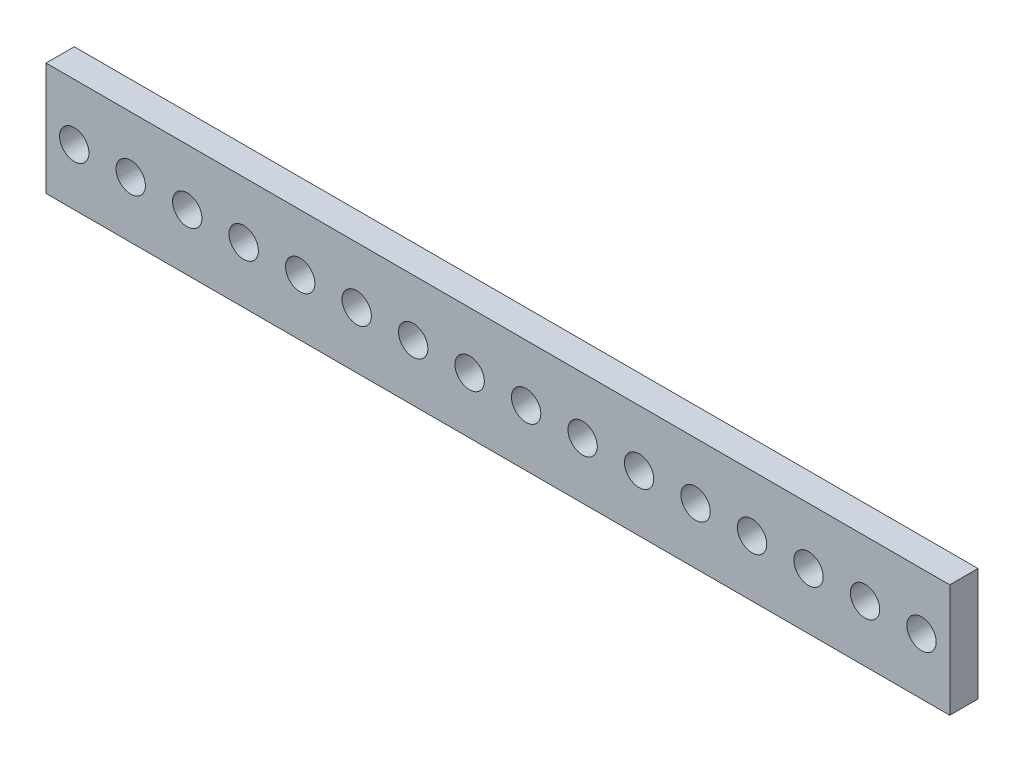
ISO-10303-21;
HEADER;
FILE_DESCRIPTION(('STEP AP214'),'2;1');
FILE_NAME('part.step','',(''),(''),'','','');
FILE_SCHEMA(('AUTOMOTIVE_DESIGN { 1 0 10303 214 1 1 1 1 }'));
ENDSEC;
DATA;
#1=APPLICATION_CONTEXT('core data for automotive mechanical design processes');
#2=APPLICATION_PROTOCOL_DEFINITION('international standard','automotive_design',2000,#1);
#3=PRODUCT_CONTEXT('',#1,'mechanical');
#4=PRODUCT('Part','Part','',(#3));
#5=PRODUCT_RELATED_PRODUCT_CATEGORY('part','',(#4));
#6=PRODUCT_DEFINITION_FORMATION('','',#4);
#7=PRODUCT_DEFINITION_CONTEXT('part definition',#1,'design');
#8=PRODUCT_DEFINITION('design','',#6,#7);
#9=PRODUCT_DEFINITION_SHAPE('','',#8);
#10=(LENGTH_UNIT() NAMED_UNIT(*) SI_UNIT(.MILLI.,.METRE.));
#11=(NAMED_UNIT(*) PLANE_ANGLE_UNIT() SI_UNIT($,.RADIAN.));
#12=(NAMED_UNIT(*) SI_UNIT($,.STERADIAN.) SOLID_ANGLE_UNIT());
#13=UNCERTAINTY_MEASURE_WITH_UNIT(LENGTH_MEASURE(1.E-05),#10,'distance_accuracy_value','');
#14=(GEOMETRIC_REPRESENTATION_CONTEXT(3) GLOBAL_UNCERTAINTY_ASSIGNED_CONTEXT((#13)) GLOBAL_UNIT_ASSIGNED_CONTEXT((#10,
#11,#12)) REPRESENTATION_CONTEXT('',''));
#15=CARTESIAN_POINT('',(0.,0.,0.));
#16=DIRECTION('',(0.,0.,1.));
#17=DIRECTION('',(1.,0.,0.));
#18=AXIS2_PLACEMENT_3D('',#15,#16,#17);
#19=CARTESIAN_POINT('',(0.,0.,3.175));
#20=DIRECTION('',(0.,0.,-1.));
#21=DIRECTION('',(-1.,0.,0.));
#22=AXIS2_PLACEMENT_3D('',#19,#20,#21);
#23=PLANE('',#22);
#24=CARTESIAN_POINT('',(53.975,6.35,3.175));
#25=DIRECTION('',(0.,0.,-1.));
#26=DIRECTION('',(-1.,0.,0.));
#27=AXIS2_PLACEMENT_3D('',#24,#25,#26);
#28=CIRCLE('',#27,1.651);
#29=CARTESIAN_POINT('',(52.324,6.35,3.175));
#30=VERTEX_POINT('',#29);
#31=EDGE_CURVE('E165',#30,#30,#28,.T.);
#32=ORIENTED_EDGE('',*,*,#31,.T.);
#33=EDGE_LOOP('',(#32));
#34=FACE_BOUND('',#33,.T.);
#35=CARTESIAN_POINT('',(60.325,6.35,3.175));
#36=DIRECTION('',(0.,0.,-1.));
#37=DIRECTION('',(-1.,0.,0.));
#38=AXIS2_PLACEMENT_3D('',#35,#36,#37);
#39=CIRCLE('',#38,1.651);
#40=CARTESIAN_POINT('',(58.674,6.35,3.175));
#41=VERTEX_POINT('',#40);
#42=EDGE_CURVE('E160',#41,#41,#39,.T.);
#43=ORIENTED_EDGE('',*,*,#42,.T.);
#44=EDGE_LOOP('',(#43));
#45=FACE_BOUND('',#44,.T.);
#46=CARTESIAN_POINT('',(66.675,6.35,3.175));
#47=DIRECTION('',(0.,0.,-1.));
#48=DIRECTION('',(-1.,0.,0.));
#49=AXIS2_PLACEMENT_3D('',#46,#47,#48);
#50=CIRCLE('',#49,1.65099999999999);
#51=CARTESIAN_POINT('',(65.024,6.35,3.175));
#52=VERTEX_POINT('',#51);
#53=EDGE_CURVE('E155',#52,#52,#50,.T.);
#54=ORIENTED_EDGE('',*,*,#53,.T.);
#55=EDGE_LOOP('',(#54));
#56=FACE_BOUND('',#55,.T.);
#57=CARTESIAN_POINT('',(73.025,6.35,3.175));
#58=DIRECTION('',(0.,0.,-1.));
#59=DIRECTION('',(-1.,0.,0.));
#60=AXIS2_PLACEMENT_3D('',#57,#58,#59);
#61=CIRCLE('',#60,1.65100000000001);
#62=CARTESIAN_POINT('',(71.374,6.35,3.175));
#63=VERTEX_POINT('',#62);
#64=EDGE_CURVE('E150',#63,#63,#61,.T.);
#65=ORIENTED_EDGE('',*,*,#64,.T.);
#66=EDGE_LOOP('',(#65));
#67=FACE_BOUND('',#66,.T.);
#68=CARTESIAN_POINT('',(79.375,6.35,3.175));
#69=DIRECTION('',(0.,0.,-1.));
#70=DIRECTION('',(-1.,0.,0.));
#71=AXIS2_PLACEMENT_3D('',#68,#69,#70);
#72=CIRCLE('',#71,1.65100000000001);
#73=CARTESIAN_POINT('',(77.724,6.35,3.175));
#74=VERTEX_POINT('',#73);
#75=EDGE_CURVE('E145',#74,#74,#72,.T.);
#76=ORIENTED_EDGE('',*,*,#75,.T.);
#77=EDGE_LOOP('',(#76));
#78=FACE_BOUND('',#77,.T.);
#79=CARTESIAN_POINT('',(85.725,6.35,3.175));
#80=DIRECTION('',(0.,0.,-1.));
#81=DIRECTION('',(-1.,0.,0.));
#82=AXIS2_PLACEMENT_3D('',#79,#80,#81);
#83=CIRCLE('',#82,1.65099999999999);
#84=CARTESIAN_POINT('',(84.074,6.35,3.175));
#85=VERTEX_POINT('',#84);
#86=EDGE_CURVE('E140',#85,#85,#83,.T.);
#87=ORIENTED_EDGE('',*,*,#86,.T.);
#88=EDGE_LOOP('',(#87));
#89=FACE_BOUND('',#88,.T.);
#90=CARTESIAN_POINT('',(92.075,6.35,3.175));
#91=DIRECTION('',(0.,0.,-1.));
#92=DIRECTION('',(-1.,0.,0.));
#93=AXIS2_PLACEMENT_3D('',#90,#91,#92);
#94=CIRCLE('',#93,1.65100000000001);
#95=CARTESIAN_POINT('',(90.424,6.35,3.175));
#96=VERTEX_POINT('',#95);
#97=EDGE_CURVE('E135',#96,#96,#94,.T.);
#98=ORIENTED_EDGE('',*,*,#97,.T.);
#99=EDGE_LOOP('',(#98));
#100=FACE_BOUND('',#99,.T.);
#101=CARTESIAN_POINT('',(98.425,6.35,3.175));
#102=DIRECTION('',(0.,0.,-1.));
#103=DIRECTION('',(-1.,0.,0.));
#104=AXIS2_PLACEMENT_3D('',#101,#102,#103);
#105=CIRCLE('',#104,1.65100000000001);
#106=CARTESIAN_POINT('',(96.774,6.35,3.175));
#107=VERTEX_POINT('',#106);
#108=EDGE_CURVE('E130',#107,#107,#105,.T.);
#109=ORIENTED_EDGE('',*,*,#108,.T.);
#110=EDGE_LOOP('',(#109));
#111=FACE_BOUND('',#110,.T.);
#112=DIRECTION('',(0.,-1.,0.));
#113=VECTOR('',#112,1.);
#114=CARTESIAN_POINT('',(0.,0.,3.175));
#115=LINE('',#114,#113);
#116=CARTESIAN_POINT('',(0.,12.7,3.175));
#117=VERTEX_POINT('',#116);
#118=CARTESIAN_POINT('',(0.,0.,3.175));
#119=VERTEX_POINT('',#118);
#120=EDGE_CURVE('E94',#117,#119,#115,.T.);
#121=ORIENTED_EDGE('',*,*,#120,.T.);
#122=DIRECTION('',(1.,0.,0.));
#123=VECTOR('',#122,1.);
#124=CARTESIAN_POINT('',(0.,0.,3.175));
#125=LINE('',#124,#123);
#126=CARTESIAN_POINT('',(101.6,0.,3.175));
#127=VERTEX_POINT('',#126);
#128=EDGE_CURVE('E89',#119,#127,#125,.T.);
#129=ORIENTED_EDGE('',*,*,#128,.T.);
#130=DIRECTION('',(0.,1.,0.));
#131=VECTOR('',#130,1.);
#132=CARTESIAN_POINT('',(101.6,0.,3.175));
#133=LINE('',#132,#131);
#134=CARTESIAN_POINT('',(101.6,12.7,3.175));
#135=VERTEX_POINT('',#134);
#136=EDGE_CURVE('E92',#127,#135,#133,.T.);
#137=ORIENTED_EDGE('',*,*,#136,.T.);
#138=DIRECTION('',(-1.,0.,0.));
#139=VECTOR('',#138,1.);
#140=CARTESIAN_POINT('',(0.,12.7,3.175));
#141=LINE('',#140,#139);
#142=EDGE_CURVE('E59',#135,#117,#141,.T.);
#143=ORIENTED_EDGE('',*,*,#142,.T.);
#144=EDGE_LOOP('',(#121,#129,#137,#143));
#145=FACE_BOUND('',#144,.T.);
#146=CARTESIAN_POINT('',(47.625,6.35,3.175));
#147=DIRECTION('',(0.,0.,-1.));
#148=DIRECTION('',(-1.,0.,0.));
#149=AXIS2_PLACEMENT_3D('',#146,#147,#148);
#150=CIRCLE('',#149,1.651);
#151=CARTESIAN_POINT('',(45.974,6.35,3.175));
#152=VERTEX_POINT('',#151);
#153=EDGE_CURVE('E170',#152,#152,#150,.F.);
#154=ORIENTED_EDGE('',*,*,#153,.F.);
#155=EDGE_LOOP('',(#154));
#156=FACE_BOUND('',#155,.T.);
#157=CARTESIAN_POINT('',(41.275,6.35,3.175));
#158=DIRECTION('',(0.,0.,-1.));
#159=DIRECTION('',(-1.,0.,0.));
#160=AXIS2_PLACEMENT_3D('',#157,#158,#159);
#161=CIRCLE('',#160,1.651);
#162=CARTESIAN_POINT('',(39.624,6.35,3.175));
#163=VERTEX_POINT('',#162);
#164=EDGE_CURVE('E175',#163,#163,#161,.F.);
#165=ORIENTED_EDGE('',*,*,#164,.F.);
#166=EDGE_LOOP('',(#165));
#167=FACE_BOUND('',#166,.T.);
#168=CARTESIAN_POINT('',(34.925,6.35,3.175));
#169=DIRECTION('',(0.,0.,-1.));
#170=DIRECTION('',(-1.,0.,0.));
#171=AXIS2_PLACEMENT_3D('',#168,#169,#170);
#172=CIRCLE('',#171,1.651);
#173=CARTESIAN_POINT('',(33.274,6.35,3.175));
#174=VERTEX_POINT('',#173);
#175=EDGE_CURVE('E180',#174,#174,#172,.F.);
#176=ORIENTED_EDGE('',*,*,#175,.F.);
#177=EDGE_LOOP('',(#176));
#178=FACE_BOUND('',#177,.T.);
#179=CARTESIAN_POINT('',(28.575,6.35,3.175));
#180=DIRECTION('',(0.,0.,-1.));
#181=DIRECTION('',(-1.,0.,0.));
#182=AXIS2_PLACEMENT_3D('',#179,#180,#181);
#183=CIRCLE('',#182,1.651);
#184=CARTESIAN_POINT('',(26.924,6.35,3.175));
#185=VERTEX_POINT('',#184);
#186=EDGE_CURVE('E185',#185,#185,#183,.F.);
#187=ORIENTED_EDGE('',*,*,#186,.F.);
#188=EDGE_LOOP('',(#187));
#189=FACE_BOUND('',#188,.T.);
#190=CARTESIAN_POINT('',(22.225,6.35,3.175));
#191=DIRECTION('',(0.,0.,-1.));
#192=DIRECTION('',(-1.,0.,0.));
#193=AXIS2_PLACEMENT_3D('',#190,#191,#192);
#194=CIRCLE('',#193,1.651);
#195=CARTESIAN_POINT('',(20.574,6.35,3.175));
#196=VERTEX_POINT('',#195);
#197=EDGE_CURVE('E190',#196,#196,#194,.F.);
#198=ORIENTED_EDGE('',*,*,#197,.F.);
#199=EDGE_LOOP('',(#198));
#200=FACE_BOUND('',#199,.T.);
#201=CARTESIAN_POINT('',(15.875,6.35,3.175));
#202=DIRECTION('',(0.,0.,-1.));
#203=DIRECTION('',(-1.,0.,0.));
#204=AXIS2_PLACEMENT_3D('',#201,#202,#203);
#205=CIRCLE('',#204,1.651);
#206=CARTESIAN_POINT('',(14.224,6.35,3.175));
#207=VERTEX_POINT('',#206);
#208=EDGE_CURVE('E194',#207,#207,#205,.F.);
#209=ORIENTED_EDGE('',*,*,#208,.F.);
#210=EDGE_LOOP('',(#209));
#211=FACE_BOUND('',#210,.T.);
#212=CARTESIAN_POINT('',(9.525,6.35,3.175));
#213=DIRECTION('',(0.,0.,-1.));
#214=DIRECTION('',(-1.,0.,0.));
#215=AXIS2_PLACEMENT_3D('',#212,#213,#214);
#216=CIRCLE('',#215,1.651);
#217=CARTESIAN_POINT('',(7.874,6.35,3.175));
#218=VERTEX_POINT('',#217);
#219=EDGE_CURVE('E198',#218,#218,#216,.F.);
#220=ORIENTED_EDGE('',*,*,#219,.F.);
#221=EDGE_LOOP('',(#220));
#222=FACE_BOUND('',#221,.T.);
#223=CARTESIAN_POINT('',(3.175,6.35,3.175));
#224=DIRECTION('',(0.,0.,-1.));
#225=DIRECTION('',(-1.,0.,0.));
#226=AXIS2_PLACEMENT_3D('',#223,#224,#225);
#227=CIRCLE('',#226,1.651);
#228=CARTESIAN_POINT('',(1.524,6.35,3.175));
#229=VERTEX_POINT('',#228);
#230=EDGE_CURVE('E115',#229,#229,#227,.F.);
#231=ORIENTED_EDGE('',*,*,#230,.F.);
#232=EDGE_LOOP('',(#231));
#233=FACE_BOUND('',#232,.T.);
#234=ADVANCED_FACE('F39',(#34,#45,#56,#67,#78,#89,#100,#111,#145,#156,#167,#178,#189,#200,#211,
#222,#233),#23,.F.);
#235=CARTESIAN_POINT('',(0.,0.,0.));
#236=DIRECTION('',(0.,0.,-1.));
#237=DIRECTION('',(-1.,0.,0.));
#238=AXIS2_PLACEMENT_3D('',#235,#236,#237);
#239=PLANE('',#238);
#240=CARTESIAN_POINT('',(9.525,6.35,0.));
#241=DIRECTION('',(0.,0.,-1.));
#242=DIRECTION('',(-1.,0.,0.));
#243=AXIS2_PLACEMENT_3D('',#240,#241,#242);
#244=CIRCLE('',#243,1.651);
#245=CARTESIAN_POINT('',(7.874,6.35,0.));
#246=VERTEX_POINT('',#245);
#247=EDGE_CURVE('E195',#246,#246,#244,.F.);
#248=ORIENTED_EDGE('',*,*,#247,.T.);
#249=EDGE_LOOP('',(#248));
#250=FACE_BOUND('',#249,.T.);
#251=CARTESIAN_POINT('',(22.225,6.35,0.));
#252=DIRECTION('',(0.,0.,-1.));
#253=DIRECTION('',(-1.,0.,0.));
#254=AXIS2_PLACEMENT_3D('',#251,#252,#253);
#255=CIRCLE('',#254,1.651);
#256=CARTESIAN_POINT('',(20.574,6.35,0.));
#257=VERTEX_POINT('',#256);
#258=EDGE_CURVE('E186',#257,#257,#255,.F.);
#259=ORIENTED_EDGE('',*,*,#258,.T.);
#260=EDGE_LOOP('',(#259));
#261=FACE_BOUND('',#260,.T.);
#262=CARTESIAN_POINT('',(34.925,6.35,0.));
#263=DIRECTION('',(0.,0.,-1.));
#264=DIRECTION('',(-1.,0.,0.));
#265=AXIS2_PLACEMENT_3D('',#262,#263,#264);
#266=CIRCLE('',#265,1.651);
#267=CARTESIAN_POINT('',(33.274,6.35,0.));
#268=VERTEX_POINT('',#267);
#269=EDGE_CURVE('E176',#268,#268,#266,.F.);
#270=ORIENTED_EDGE('',*,*,#269,.T.);
#271=EDGE_LOOP('',(#270));
#272=FACE_BOUND('',#271,.T.);
#273=CARTESIAN_POINT('',(47.625,6.35,0.));
#274=DIRECTION('',(0.,0.,-1.));
#275=DIRECTION('',(-1.,0.,0.));
#276=AXIS2_PLACEMENT_3D('',#273,#274,#275);
#277=CIRCLE('',#276,1.651);
#278=CARTESIAN_POINT('',(45.974,6.35,0.));
#279=VERTEX_POINT('',#278);
#280=EDGE_CURVE('E166',#279,#279,#277,.F.);
#281=ORIENTED_EDGE('',*,*,#280,.T.);
#282=EDGE_LOOP('',(#281));
#283=FACE_BOUND('',#282,.T.);
#284=CARTESIAN_POINT('',(53.975,6.35,0.));
#285=DIRECTION('',(0.,0.,-1.));
#286=DIRECTION('',(-1.,0.,0.));
#287=AXIS2_PLACEMENT_3D('',#284,#285,#286);
#288=CIRCLE('',#287,1.651);
#289=CARTESIAN_POINT('',(52.324,6.35,0.));
#290=VERTEX_POINT('',#289);
#291=EDGE_CURVE('E161',#290,#290,#288,.T.);
#292=ORIENTED_EDGE('',*,*,#291,.F.);
#293=EDGE_LOOP('',(#292));
#294=FACE_BOUND('',#293,.T.);
#295=CARTESIAN_POINT('',(60.325,6.35,0.));
#296=DIRECTION('',(0.,0.,-1.));
#297=DIRECTION('',(-1.,0.,0.));
#298=AXIS2_PLACEMENT_3D('',#295,#296,#297);
#299=CIRCLE('',#298,1.651);
#300=CARTESIAN_POINT('',(58.674,6.35,0.));
#301=VERTEX_POINT('',#300);
#302=EDGE_CURVE('E156',#301,#301,#299,.T.);
#303=ORIENTED_EDGE('',*,*,#302,.F.);
#304=EDGE_LOOP('',(#303));
#305=FACE_BOUND('',#304,.T.);
#306=CARTESIAN_POINT('',(66.675,6.35,0.));
#307=DIRECTION('',(0.,0.,-1.));
#308=DIRECTION('',(-1.,0.,0.));
#309=AXIS2_PLACEMENT_3D('',#306,#307,#308);
#310=CIRCLE('',#309,1.65099999999999);
#311=CARTESIAN_POINT('',(65.024,6.35,0.));
#312=VERTEX_POINT('',#311);
#313=EDGE_CURVE('E151',#312,#312,#310,.T.);
#314=ORIENTED_EDGE('',*,*,#313,.F.);
#315=EDGE_LOOP('',(#314));
#316=FACE_BOUND('',#315,.T.);
#317=CARTESIAN_POINT('',(73.025,6.35,0.));
#318=DIRECTION('',(0.,0.,-1.));
#319=DIRECTION('',(-1.,0.,0.));
#320=AXIS2_PLACEMENT_3D('',#317,#318,#319);
#321=CIRCLE('',#320,1.65100000000001);
#322=CARTESIAN_POINT('',(71.374,6.35,0.));
#323=VERTEX_POINT('',#322);
#324=EDGE_CURVE('E146',#323,#323,#321,.T.);
#325=ORIENTED_EDGE('',*,*,#324,.F.);
#326=EDGE_LOOP('',(#325));
#327=FACE_BOUND('',#326,.T.);
#328=CARTESIAN_POINT('',(79.375,6.35,0.));
#329=DIRECTION('',(0.,0.,-1.));
#330=DIRECTION('',(-1.,0.,0.));
#331=AXIS2_PLACEMENT_3D('',#328,#329,#330);
#332=CIRCLE('',#331,1.65100000000001);
#333=CARTESIAN_POINT('',(77.724,6.35,0.));
#334=VERTEX_POINT('',#333);
#335=EDGE_CURVE('E141',#334,#334,#332,.T.);
#336=ORIENTED_EDGE('',*,*,#335,.F.);
#337=EDGE_LOOP('',(#336));
#338=FACE_BOUND('',#337,.T.);
#339=CARTESIAN_POINT('',(85.725,6.35,0.));
#340=DIRECTION('',(0.,0.,-1.));
#341=DIRECTION('',(-1.,0.,0.));
#342=AXIS2_PLACEMENT_3D('',#339,#340,#341);
#343=CIRCLE('',#342,1.65099999999999);
#344=CARTESIAN_POINT('',(84.074,6.35,0.));
#345=VERTEX_POINT('',#344);
#346=EDGE_CURVE('E136',#345,#345,#343,.T.);
#347=ORIENTED_EDGE('',*,*,#346,.F.);
#348=EDGE_LOOP('',(#347));
#349=FACE_BOUND('',#348,.T.);
#350=CARTESIAN_POINT('',(92.075,6.35,0.));
#351=DIRECTION('',(0.,0.,-1.));
#352=DIRECTION('',(-1.,0.,0.));
#353=AXIS2_PLACEMENT_3D('',#350,#351,#352);
#354=CIRCLE('',#353,1.65100000000001);
#355=CARTESIAN_POINT('',(90.424,6.35,0.));
#356=VERTEX_POINT('',#355);
#357=EDGE_CURVE('E131',#356,#356,#354,.T.);
#358=ORIENTED_EDGE('',*,*,#357,.F.);
#359=EDGE_LOOP('',(#358));
#360=FACE_BOUND('',#359,.T.);
#361=CARTESIAN_POINT('',(98.425,6.35,0.));
#362=DIRECTION('',(0.,0.,-1.));
#363=DIRECTION('',(-1.,0.,0.));
#364=AXIS2_PLACEMENT_3D('',#361,#362,#363);
#365=CIRCLE('',#364,1.65100000000001);
#366=CARTESIAN_POINT('',(96.774,6.35,0.));
#367=VERTEX_POINT('',#366);
#368=EDGE_CURVE('E126',#367,#367,#365,.T.);
#369=ORIENTED_EDGE('',*,*,#368,.F.);
#370=EDGE_LOOP('',(#369));
#371=FACE_BOUND('',#370,.T.);
#372=DIRECTION('',(0.,-1.,0.));
#373=VECTOR('',#372,1.);
#374=CARTESIAN_POINT('',(0.,0.,0.));
#375=LINE('',#374,#373);
#376=CARTESIAN_POINT('',(0.,12.7,0.));
#377=VERTEX_POINT('',#376);
#378=CARTESIAN_POINT('',(0.,0.,0.));
#379=VERTEX_POINT('',#378);
#380=EDGE_CURVE('E111',#377,#379,#375,.T.);
#381=ORIENTED_EDGE('',*,*,#380,.F.);
#382=DIRECTION('',(-1.,0.,0.));
#383=VECTOR('',#382,1.);
#384=CARTESIAN_POINT('',(0.,12.7,0.));
#385=LINE('',#384,#383);
#386=CARTESIAN_POINT('',(101.6,12.7,0.));
#387=VERTEX_POINT('',#386);
#388=EDGE_CURVE('E82',#387,#377,#385,.T.);
#389=ORIENTED_EDGE('',*,*,#388,.F.);
#390=DIRECTION('',(0.,1.,0.));
#391=VECTOR('',#390,1.);
#392=CARTESIAN_POINT('',(101.6,0.,0.));
#393=LINE('',#392,#391);
#394=CARTESIAN_POINT('',(101.6,0.,0.));
#395=VERTEX_POINT('',#394);
#396=EDGE_CURVE('E76',#395,#387,#393,.T.);
#397=ORIENTED_EDGE('',*,*,#396,.F.);
#398=DIRECTION('',(1.,0.,0.));
#399=VECTOR('',#398,1.);
#400=CARTESIAN_POINT('',(0.,0.,0.));
#401=LINE('',#400,#399);
#402=EDGE_CURVE('E99',#379,#395,#401,.T.);
#403=ORIENTED_EDGE('',*,*,#402,.F.);
#404=EDGE_LOOP('',(#381,#389,#397,#403));
#405=FACE_BOUND('',#404,.T.);
#406=CARTESIAN_POINT('',(41.275,6.35,0.));
#407=DIRECTION('',(0.,0.,-1.));
#408=DIRECTION('',(-1.,0.,0.));
#409=AXIS2_PLACEMENT_3D('',#406,#407,#408);
#410=CIRCLE('',#409,1.651);
#411=CARTESIAN_POINT('',(39.624,6.35,0.));
#412=VERTEX_POINT('',#411);
#413=EDGE_CURVE('E171',#412,#412,#410,.F.);
#414=ORIENTED_EDGE('',*,*,#413,.T.);
#415=EDGE_LOOP('',(#414));
#416=FACE_BOUND('',#415,.T.);
#417=CARTESIAN_POINT('',(28.575,6.35,0.));
#418=DIRECTION('',(0.,0.,-1.));
#419=DIRECTION('',(-1.,0.,0.));
#420=AXIS2_PLACEMENT_3D('',#417,#418,#419);
#421=CIRCLE('',#420,1.651);
#422=CARTESIAN_POINT('',(26.924,6.35,0.));
#423=VERTEX_POINT('',#422);
#424=EDGE_CURVE('E181',#423,#423,#421,.F.);
#425=ORIENTED_EDGE('',*,*,#424,.T.);
#426=EDGE_LOOP('',(#425));
#427=FACE_BOUND('',#426,.T.);
#428=CARTESIAN_POINT('',(15.875,6.35,0.));
#429=DIRECTION('',(0.,0.,-1.));
#430=DIRECTION('',(-1.,0.,0.));
#431=AXIS2_PLACEMENT_3D('',#428,#429,#430);
#432=CIRCLE('',#431,1.651);
#433=CARTESIAN_POINT('',(14.224,6.35,0.));
#434=VERTEX_POINT('',#433);
#435=EDGE_CURVE('E191',#434,#434,#432,.F.);
#436=ORIENTED_EDGE('',*,*,#435,.T.);
#437=EDGE_LOOP('',(#436));
#438=FACE_BOUND('',#437,.T.);
#439=CARTESIAN_POINT('',(3.175,6.35,0.));
#440=DIRECTION('',(0.,0.,-1.));
#441=DIRECTION('',(-1.,0.,0.));
#442=AXIS2_PLACEMENT_3D('',#439,#440,#441);
#443=CIRCLE('',#442,1.651);
#444=CARTESIAN_POINT('',(1.524,6.35,0.));
#445=VERTEX_POINT('',#444);
#446=EDGE_CURVE('E43',#445,#445,#443,.F.);
#447=ORIENTED_EDGE('',*,*,#446,.T.);
#448=EDGE_LOOP('',(#447));
#449=FACE_BOUND('',#448,.T.);
#450=ADVANCED_FACE('F219',(#250,#261,#272,#283,#294,#305,#316,#327,#338,#349,#360,#371,#405,
#416,#427,#438,#449),#239,.T.);
#451=CARTESIAN_POINT('',(0.,0.,3.175));
#452=DIRECTION('',(1.,0.,0.));
#453=DIRECTION('',(0.,0.,-1.));
#454=AXIS2_PLACEMENT_3D('',#451,#452,#453);
#455=PLANE('',#454);
#456=ORIENTED_EDGE('',*,*,#380,.T.);
#457=DIRECTION('',(0.,0.,-1.));
#458=VECTOR('',#457,1.);
#459=CARTESIAN_POINT('',(0.,0.,3.175));
#460=LINE('',#459,#458);
#461=EDGE_CURVE('E11',#119,#379,#460,.T.);
#462=ORIENTED_EDGE('',*,*,#461,.F.);
#463=ORIENTED_EDGE('',*,*,#120,.F.);
#464=DIRECTION('',(0.,0.,-1.));
#465=VECTOR('',#464,1.);
#466=CARTESIAN_POINT('',(0.,12.7,3.175));
#467=LINE('',#466,#465);
#468=EDGE_CURVE('E107',#117,#377,#467,.T.);
#469=ORIENTED_EDGE('',*,*,#468,.T.);
#470=EDGE_LOOP('',(#456,#462,#463,#469));
#471=FACE_BOUND('',#470,.T.);
#472=ADVANCED_FACE('F41',(#471),#455,.F.);
#473=CARTESIAN_POINT('',(0.,0.,3.175));
#474=DIRECTION('',(0.,1.,0.));
#475=DIRECTION('',(0.,0.,1.));
#476=AXIS2_PLACEMENT_3D('',#473,#474,#475);
#477=PLANE('',#476);
#478=ORIENTED_EDGE('',*,*,#402,.T.);
#479=DIRECTION('',(0.,0.,-1.));
#480=VECTOR('',#479,1.);
#481=CARTESIAN_POINT('',(101.6,0.,3.175));
#482=LINE('',#481,#480);
#483=EDGE_CURVE('E50',#127,#395,#482,.T.);
#484=ORIENTED_EDGE('',*,*,#483,.F.);
#485=ORIENTED_EDGE('',*,*,#128,.F.);
#486=ORIENTED_EDGE('',*,*,#461,.T.);
#487=EDGE_LOOP('',(#478,#484,#485,#486));
#488=FACE_BOUND('',#487,.T.);
#489=ADVANCED_FACE('F98',(#488),#477,.F.);
#490=CARTESIAN_POINT('',(101.6,0.,3.175));
#491=DIRECTION('',(-1.,0.,0.));
#492=DIRECTION('',(0.,0.,1.));
#493=AXIS2_PLACEMENT_3D('',#490,#491,#492);
#494=PLANE('',#493);
#495=ORIENTED_EDGE('',*,*,#396,.T.);
#496=DIRECTION('',(0.,0.,-1.));
#497=VECTOR('',#496,1.);
#498=CARTESIAN_POINT('',(101.6,12.7,3.175));
#499=LINE('',#498,#497);
#500=EDGE_CURVE('E101',#135,#387,#499,.T.);
#501=ORIENTED_EDGE('',*,*,#500,.F.);
#502=ORIENTED_EDGE('',*,*,#136,.F.);
#503=ORIENTED_EDGE('',*,*,#483,.T.);
#504=EDGE_LOOP('',(#495,#501,#502,#503));
#505=FACE_BOUND('',#504,.T.);
#506=ADVANCED_FACE('F103',(#505),#494,.F.);
#507=CARTESIAN_POINT('',(0.,12.7,3.175));
#508=DIRECTION('',(0.,-1.,0.));
#509=DIRECTION('',(0.,0.,-1.));
#510=AXIS2_PLACEMENT_3D('',#507,#508,#509);
#511=PLANE('',#510);
#512=ORIENTED_EDGE('',*,*,#388,.T.);
#513=ORIENTED_EDGE('',*,*,#468,.F.);
#514=ORIENTED_EDGE('',*,*,#142,.F.);
#515=ORIENTED_EDGE('',*,*,#500,.T.);
#516=EDGE_LOOP('',(#512,#513,#514,#515));
#517=FACE_BOUND('',#516,.T.);
#518=ADVANCED_FACE('F241',(#517),#511,.F.);
#519=CARTESIAN_POINT('',(98.425,6.35,127.));
#520=DIRECTION('',(0.,0.,-1.));
#521=DIRECTION('',(-1.,0.,0.));
#522=AXIS2_PLACEMENT_3D('',#519,#520,#521);
#523=CYLINDRICAL_SURFACE('',#522,1.65100000000001);
#524=ORIENTED_EDGE('',*,*,#368,.T.);
#525=EDGE_LOOP('',(#524));
#526=FACE_BOUND('',#525,.T.);
#527=ORIENTED_EDGE('',*,*,#108,.F.);
#528=EDGE_LOOP('',(#527));
#529=FACE_BOUND('',#528,.T.);
#530=ADVANCED_FACE('F238',(#526,#529),#523,.F.);
#531=CARTESIAN_POINT('',(92.075,6.35,127.));
#532=DIRECTION('',(0.,0.,-1.));
#533=DIRECTION('',(-1.,0.,0.));
#534=AXIS2_PLACEMENT_3D('',#531,#532,#533);
#535=CYLINDRICAL_SURFACE('',#534,1.65100000000001);
#536=ORIENTED_EDGE('',*,*,#357,.T.);
#537=EDGE_LOOP('',(#536));
#538=FACE_BOUND('',#537,.T.);
#539=ORIENTED_EDGE('',*,*,#97,.F.);
#540=EDGE_LOOP('',(#539));
#541=FACE_BOUND('',#540,.T.);
#542=ADVANCED_FACE('F312',(#538,#541),#535,.F.);
#543=CARTESIAN_POINT('',(85.725,6.35,127.));
#544=DIRECTION('',(0.,0.,-1.));
#545=DIRECTION('',(-1.,0.,0.));
#546=AXIS2_PLACEMENT_3D('',#543,#544,#545);
#547=CYLINDRICAL_SURFACE('',#546,1.65099999999999);
#548=ORIENTED_EDGE('',*,*,#346,.T.);
#549=EDGE_LOOP('',(#548));
#550=FACE_BOUND('',#549,.T.);
#551=ORIENTED_EDGE('',*,*,#86,.F.);
#552=EDGE_LOOP('',(#551));
#553=FACE_BOUND('',#552,.T.);
#554=ADVANCED_FACE('F309',(#550,#553),#547,.F.);
#555=CARTESIAN_POINT('',(79.375,6.35,127.));
#556=DIRECTION('',(0.,0.,-1.));
#557=DIRECTION('',(-1.,0.,0.));
#558=AXIS2_PLACEMENT_3D('',#555,#556,#557);
#559=CYLINDRICAL_SURFACE('',#558,1.65100000000001);
#560=ORIENTED_EDGE('',*,*,#335,.T.);
#561=EDGE_LOOP('',(#560));
#562=FACE_BOUND('',#561,.T.);
#563=ORIENTED_EDGE('',*,*,#75,.F.);
#564=EDGE_LOOP('',(#563));
#565=FACE_BOUND('',#564,.T.);
#566=ADVANCED_FACE('F305',(#562,#565),#559,.F.);
#567=CARTESIAN_POINT('',(73.025,6.35,127.));
#568=DIRECTION('',(0.,0.,-1.));
#569=DIRECTION('',(-1.,0.,0.));
#570=AXIS2_PLACEMENT_3D('',#567,#568,#569);
#571=CYLINDRICAL_SURFACE('',#570,1.65100000000001);
#572=ORIENTED_EDGE('',*,*,#324,.T.);
#573=EDGE_LOOP('',(#572));
#574=FACE_BOUND('',#573,.T.);
#575=ORIENTED_EDGE('',*,*,#64,.F.);
#576=EDGE_LOOP('',(#575));
#577=FACE_BOUND('',#576,.T.);
#578=ADVANCED_FACE('F301',(#574,#577),#571,.F.);
#579=CARTESIAN_POINT('',(66.675,6.35,127.));
#580=DIRECTION('',(0.,0.,-1.));
#581=DIRECTION('',(-1.,0.,0.));
#582=AXIS2_PLACEMENT_3D('',#579,#580,#581);
#583=CYLINDRICAL_SURFACE('',#582,1.65099999999999);
#584=ORIENTED_EDGE('',*,*,#313,.T.);
#585=EDGE_LOOP('',(#584));
#586=FACE_BOUND('',#585,.T.);
#587=ORIENTED_EDGE('',*,*,#53,.F.);
#588=EDGE_LOOP('',(#587));
#589=FACE_BOUND('',#588,.T.);
#590=ADVANCED_FACE('F297',(#586,#589),#583,.F.);
#591=CARTESIAN_POINT('',(60.325,6.35,127.));
#592=DIRECTION('',(0.,0.,-1.));
#593=DIRECTION('',(-1.,0.,0.));
#594=AXIS2_PLACEMENT_3D('',#591,#592,#593);
#595=CYLINDRICAL_SURFACE('',#594,1.651);
#596=ORIENTED_EDGE('',*,*,#302,.T.);
#597=EDGE_LOOP('',(#596));
#598=FACE_BOUND('',#597,.T.);
#599=ORIENTED_EDGE('',*,*,#42,.F.);
#600=EDGE_LOOP('',(#599));
#601=FACE_BOUND('',#600,.T.);
#602=ADVANCED_FACE('F293',(#598,#601),#595,.F.);
#603=CARTESIAN_POINT('',(53.975,6.35,127.));
#604=DIRECTION('',(0.,0.,-1.));
#605=DIRECTION('',(-1.,0.,0.));
#606=AXIS2_PLACEMENT_3D('',#603,#604,#605);
#607=CYLINDRICAL_SURFACE('',#606,1.651);
#608=ORIENTED_EDGE('',*,*,#291,.T.);
#609=EDGE_LOOP('',(#608));
#610=FACE_BOUND('',#609,.T.);
#611=ORIENTED_EDGE('',*,*,#31,.F.);
#612=EDGE_LOOP('',(#611));
#613=FACE_BOUND('',#612,.T.);
#614=ADVANCED_FACE('F289',(#610,#613),#607,.F.);
#615=CARTESIAN_POINT('',(47.625,6.35,127.));
#616=DIRECTION('',(0.,0.,-1.));
#617=DIRECTION('',(-1.,0.,0.));
#618=AXIS2_PLACEMENT_3D('',#615,#616,#617);
#619=CYLINDRICAL_SURFACE('',#618,1.651);
#620=ORIENTED_EDGE('',*,*,#280,.F.);
#621=EDGE_LOOP('',(#620));
#622=FACE_BOUND('',#621,.T.);
#623=ORIENTED_EDGE('',*,*,#153,.T.);
#624=EDGE_LOOP('',(#623));
#625=FACE_BOUND('',#624,.T.);
#626=ADVANCED_FACE('F285',(#622,#625),#619,.F.);
#627=CARTESIAN_POINT('',(41.275,6.35,127.));
#628=DIRECTION('',(0.,0.,-1.));
#629=DIRECTION('',(-1.,0.,0.));
#630=AXIS2_PLACEMENT_3D('',#627,#628,#629);
#631=CYLINDRICAL_SURFACE('',#630,1.651);
#632=ORIENTED_EDGE('',*,*,#413,.F.);
#633=EDGE_LOOP('',(#632));
#634=FACE_BOUND('',#633,.T.);
#635=ORIENTED_EDGE('',*,*,#164,.T.);
#636=EDGE_LOOP('',(#635));
#637=FACE_BOUND('',#636,.T.);
#638=ADVANCED_FACE('F281',(#634,#637),#631,.F.);
#639=CARTESIAN_POINT('',(34.925,6.35,127.));
#640=DIRECTION('',(0.,0.,-1.));
#641=DIRECTION('',(-1.,0.,0.));
#642=AXIS2_PLACEMENT_3D('',#639,#640,#641);
#643=CYLINDRICAL_SURFACE('',#642,1.651);
#644=ORIENTED_EDGE('',*,*,#269,.F.);
#645=EDGE_LOOP('',(#644));
#646=FACE_BOUND('',#645,.T.);
#647=ORIENTED_EDGE('',*,*,#175,.T.);
#648=EDGE_LOOP('',(#647));
#649=FACE_BOUND('',#648,.T.);
#650=ADVANCED_FACE('F277',(#646,#649),#643,.F.);
#651=CARTESIAN_POINT('',(28.575,6.35,127.));
#652=DIRECTION('',(0.,0.,-1.));
#653=DIRECTION('',(-1.,0.,0.));
#654=AXIS2_PLACEMENT_3D('',#651,#652,#653);
#655=CYLINDRICAL_SURFACE('',#654,1.651);
#656=ORIENTED_EDGE('',*,*,#424,.F.);
#657=EDGE_LOOP('',(#656));
#658=FACE_BOUND('',#657,.T.);
#659=ORIENTED_EDGE('',*,*,#186,.T.);
#660=EDGE_LOOP('',(#659));
#661=FACE_BOUND('',#660,.T.);
#662=ADVANCED_FACE('F271',(#658,#661),#655,.F.);
#663=CARTESIAN_POINT('',(22.225,6.35,127.));
#664=DIRECTION('',(0.,0.,-1.));
#665=DIRECTION('',(-1.,0.,0.));
#666=AXIS2_PLACEMENT_3D('',#663,#664,#665);
#667=CYLINDRICAL_SURFACE('',#666,1.651);
#668=ORIENTED_EDGE('',*,*,#258,.F.);
#669=EDGE_LOOP('',(#668));
#670=FACE_BOUND('',#669,.T.);
#671=ORIENTED_EDGE('',*,*,#197,.T.);
#672=EDGE_LOOP('',(#671));
#673=FACE_BOUND('',#672,.T.);
#674=ADVANCED_FACE('F263',(#670,#673),#667,.F.);
#675=CARTESIAN_POINT('',(15.875,6.35,127.));
#676=DIRECTION('',(0.,0.,-1.));
#677=DIRECTION('',(-1.,0.,0.));
#678=AXIS2_PLACEMENT_3D('',#675,#676,#677);
#679=CYLINDRICAL_SURFACE('',#678,1.651);
#680=ORIENTED_EDGE('',*,*,#435,.F.);
#681=EDGE_LOOP('',(#680));
#682=FACE_BOUND('',#681,.T.);
#683=ORIENTED_EDGE('',*,*,#208,.T.);
#684=EDGE_LOOP('',(#683));
#685=FACE_BOUND('',#684,.T.);
#686=ADVANCED_FACE('F261',(#682,#685),#679,.F.);
#687=CARTESIAN_POINT('',(9.525,6.35,127.));
#688=DIRECTION('',(0.,0.,-1.));
#689=DIRECTION('',(-1.,0.,0.));
#690=AXIS2_PLACEMENT_3D('',#687,#688,#689);
#691=CYLINDRICAL_SURFACE('',#690,1.651);
#692=ORIENTED_EDGE('',*,*,#247,.F.);
#693=EDGE_LOOP('',(#692));
#694=FACE_BOUND('',#693,.T.);
#695=ORIENTED_EDGE('',*,*,#219,.T.);
#696=EDGE_LOOP('',(#695));
#697=FACE_BOUND('',#696,.T.);
#698=ADVANCED_FACE('F224',(#694,#697),#691,.F.);
#699=CARTESIAN_POINT('',(3.175,6.35,127.));
#700=DIRECTION('',(0.,0.,-1.));
#701=DIRECTION('',(-1.,0.,0.));
#702=AXIS2_PLACEMENT_3D('',#699,#700,#701);
#703=CYLINDRICAL_SURFACE('',#702,1.651);
#704=ORIENTED_EDGE('',*,*,#446,.F.);
#705=EDGE_LOOP('',(#704));
#706=FACE_BOUND('',#705,.T.);
#707=ORIENTED_EDGE('',*,*,#230,.T.);
#708=EDGE_LOOP('',(#707));
#709=FACE_BOUND('',#708,.T.);
#710=ADVANCED_FACE('F221',(#706,#709),#703,.F.);
#711=CLOSED_SHELL('',(#234,#450,#472,#489,#506,#518,#530,#542,#554,#566,#578,#590,#602,#614,
#626,#638,#650,#662,#674,#686,#698,#710));
#712=MANIFOLD_SOLID_BREP('B2',#711);
#713=ADVANCED_BREP_SHAPE_REPRESENTATION('',(#18,#712),#14);
#714=SHAPE_DEFINITION_REPRESENTATION(#9,#713);
ENDSEC;
END-ISO-10303-21;
